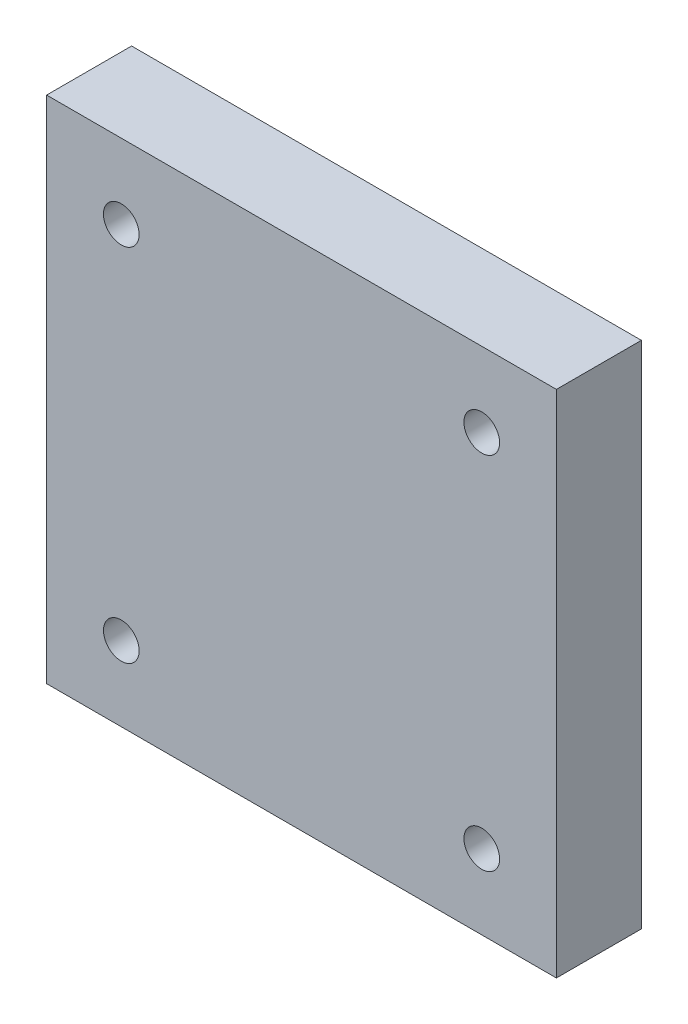
ISO-10303-21;
HEADER;
FILE_DESCRIPTION(('STEP AP214'),'2;1');
FILE_NAME('part.step','',(''),(''),'','','');
FILE_SCHEMA(('AUTOMOTIVE_DESIGN { 1 0 10303 214 1 1 1 1 }'));
ENDSEC;
DATA;
#1=APPLICATION_CONTEXT('core data for automotive mechanical design processes');
#2=APPLICATION_PROTOCOL_DEFINITION('international standard','automotive_design',2000,#1);
#3=PRODUCT_CONTEXT('',#1,'mechanical');
#4=PRODUCT('Part','Part','',(#3));
#5=PRODUCT_RELATED_PRODUCT_CATEGORY('part','',(#4));
#6=PRODUCT_DEFINITION_FORMATION('','',#4);
#7=PRODUCT_DEFINITION_CONTEXT('part definition',#1,'design');
#8=PRODUCT_DEFINITION('design','',#6,#7);
#9=PRODUCT_DEFINITION_SHAPE('','',#8);
#10=(LENGTH_UNIT() NAMED_UNIT(*) SI_UNIT(.MILLI.,.METRE.));
#11=(NAMED_UNIT(*) PLANE_ANGLE_UNIT() SI_UNIT($,.RADIAN.));
#12=(NAMED_UNIT(*) SI_UNIT($,.STERADIAN.) SOLID_ANGLE_UNIT());
#13=UNCERTAINTY_MEASURE_WITH_UNIT(LENGTH_MEASURE(1.E-05),#10,'distance_accuracy_value','');
#14=(GEOMETRIC_REPRESENTATION_CONTEXT(3) GLOBAL_UNCERTAINTY_ASSIGNED_CONTEXT((#13)) GLOBAL_UNIT_ASSIGNED_CONTEXT((#10,
#11,#12)) REPRESENTATION_CONTEXT('',''));
#15=CARTESIAN_POINT('',(0.,0.,0.));
#16=DIRECTION('',(0.,0.,1.));
#17=DIRECTION('',(1.,0.,0.));
#18=AXIS2_PLACEMENT_3D('',#15,#16,#17);
#19=CARTESIAN_POINT('',(0.,30.,5.));
#20=DIRECTION('',(0.,0.,-1.));
#21=DIRECTION('',(-1.,0.,0.));
#22=AXIS2_PLACEMENT_3D('',#19,#20,#21);
#23=PLANE('',#22);
#24=CARTESIAN_POINT('',(4.39339828220179,25.6066017177982,5.));
#25=DIRECTION('',(0.,0.,-1.));
#26=DIRECTION('',(-1.,0.,0.));
#27=AXIS2_PLACEMENT_3D('',#24,#25,#26);
#28=CIRCLE('',#27,1.05);
#29=CARTESIAN_POINT('',(3.34339828220179,25.6066017177982,5.));
#30=VERTEX_POINT('',#29);
#31=EDGE_CURVE('E114',#30,#30,#28,.F.);
#32=ORIENTED_EDGE('',*,*,#31,.F.);
#33=EDGE_LOOP('',(#32));
#34=FACE_BOUND('',#33,.T.);
#35=CARTESIAN_POINT('',(25.6066017177982,25.6066017177982,5.));
#36=DIRECTION('',(0.,0.,-1.));
#37=DIRECTION('',(-1.,0.,0.));
#38=AXIS2_PLACEMENT_3D('',#35,#36,#37);
#39=CIRCLE('',#38,1.05);
#40=CARTESIAN_POINT('',(24.5566017177982,25.6066017177982,5.));
#41=VERTEX_POINT('',#40);
#42=EDGE_CURVE('E102',#41,#41,#39,.F.);
#43=ORIENTED_EDGE('',*,*,#42,.F.);
#44=EDGE_LOOP('',(#43));
#45=FACE_BOUND('',#44,.T.);
#46=DIRECTION('',(0.,-1.,0.));
#47=VECTOR('',#46,1.);
#48=CARTESIAN_POINT('',(0.,0.,5.));
#49=LINE('',#48,#47);
#50=CARTESIAN_POINT('',(0.,30.,5.));
#51=VERTEX_POINT('',#50);
#52=CARTESIAN_POINT('',(0.,0.,5.));
#53=VERTEX_POINT('',#52);
#54=EDGE_CURVE('E86',#51,#53,#49,.T.);
#55=ORIENTED_EDGE('',*,*,#54,.T.);
#56=DIRECTION('',(1.,0.,0.));
#57=VECTOR('',#56,1.);
#58=CARTESIAN_POINT('',(0.,0.,5.));
#59=LINE('',#58,#57);
#60=CARTESIAN_POINT('',(30.,0.,5.));
#61=VERTEX_POINT('',#60);
#62=EDGE_CURVE('E81',#53,#61,#59,.T.);
#63=ORIENTED_EDGE('',*,*,#62,.T.);
#64=DIRECTION('',(0.,1.,0.));
#65=VECTOR('',#64,1.);
#66=CARTESIAN_POINT('',(30.,0.,5.));
#67=LINE('',#66,#65);
#68=CARTESIAN_POINT('',(30.,30.,5.));
#69=VERTEX_POINT('',#68);
#70=EDGE_CURVE('E84',#61,#69,#67,.T.);
#71=ORIENTED_EDGE('',*,*,#70,.T.);
#72=DIRECTION('',(-1.,0.,0.));
#73=VECTOR('',#72,1.);
#74=CARTESIAN_POINT('',(0.,30.,5.));
#75=LINE('',#74,#73);
#76=EDGE_CURVE('E51',#69,#51,#75,.T.);
#77=ORIENTED_EDGE('',*,*,#76,.T.);
#78=EDGE_LOOP('',(#55,#63,#71,#77));
#79=FACE_BOUND('',#78,.T.);
#80=CARTESIAN_POINT('',(25.6066017177982,4.39339828220178,5.));
#81=DIRECTION('',(0.,0.,-1.));
#82=DIRECTION('',(-1.,0.,0.));
#83=AXIS2_PLACEMENT_3D('',#80,#81,#82);
#84=CIRCLE('',#83,1.05);
#85=CARTESIAN_POINT('',(24.5566017177982,4.39339828220178,5.));
#86=VERTEX_POINT('',#85);
#87=EDGE_CURVE('E111',#86,#86,#84,.F.);
#88=ORIENTED_EDGE('',*,*,#87,.F.);
#89=EDGE_LOOP('',(#88));
#90=FACE_BOUND('',#89,.T.);
#91=CARTESIAN_POINT('',(4.39339828220179,4.39339828220179,5.));
#92=DIRECTION('',(0.,0.,-1.));
#93=DIRECTION('',(-1.,0.,0.));
#94=AXIS2_PLACEMENT_3D('',#91,#92,#93);
#95=CIRCLE('',#94,1.05);
#96=CARTESIAN_POINT('',(3.34339828220179,4.39339828220179,5.));
#97=VERTEX_POINT('',#96);
#98=EDGE_CURVE('E117',#97,#97,#95,.F.);
#99=ORIENTED_EDGE('',*,*,#98,.F.);
#100=EDGE_LOOP('',(#99));
#101=FACE_BOUND('',#100,.T.);
#102=ADVANCED_FACE('F32',(#34,#45,#79,#90,#101),#23,.F.);
#103=CARTESIAN_POINT('',(0.,30.,0.));
#104=DIRECTION('',(0.,0.,-1.));
#105=DIRECTION('',(-1.,0.,0.));
#106=AXIS2_PLACEMENT_3D('',#103,#104,#105);
#107=PLANE('',#106);
#108=CARTESIAN_POINT('',(4.39339828220179,25.6066017177982,0.));
#109=DIRECTION('',(0.,0.,-1.));
#110=DIRECTION('',(-1.,0.,0.));
#111=AXIS2_PLACEMENT_3D('',#108,#109,#110);
#112=CIRCLE('',#111,1.05);
#113=CARTESIAN_POINT('',(3.34339828220179,25.6066017177982,0.));
#114=VERTEX_POINT('',#113);
#115=EDGE_CURVE('E115',#114,#114,#112,.F.);
#116=ORIENTED_EDGE('',*,*,#115,.T.);
#117=EDGE_LOOP('',(#116));
#118=FACE_BOUND('',#117,.T.);
#119=CARTESIAN_POINT('',(25.6066017177982,25.6066017177982,0.));
#120=DIRECTION('',(0.,0.,-1.));
#121=DIRECTION('',(-1.,0.,0.));
#122=AXIS2_PLACEMENT_3D('',#119,#120,#121);
#123=CIRCLE('',#122,1.05);
#124=CARTESIAN_POINT('',(24.5566017177982,25.6066017177982,0.));
#125=VERTEX_POINT('',#124);
#126=EDGE_CURVE('E108',#125,#125,#123,.F.);
#127=ORIENTED_EDGE('',*,*,#126,.T.);
#128=EDGE_LOOP('',(#127));
#129=FACE_BOUND('',#128,.T.);
#130=DIRECTION('',(0.,-1.,0.));
#131=VECTOR('',#130,1.);
#132=CARTESIAN_POINT('',(0.,0.,0.));
#133=LINE('',#132,#131);
#134=CARTESIAN_POINT('',(0.,30.,0.));
#135=VERTEX_POINT('',#134);
#136=CARTESIAN_POINT('',(0.,0.,0.));
#137=VERTEX_POINT('',#136);
#138=EDGE_CURVE('E99',#135,#137,#133,.T.);
#139=ORIENTED_EDGE('',*,*,#138,.F.);
#140=DIRECTION('',(-1.,0.,0.));
#141=VECTOR('',#140,1.);
#142=CARTESIAN_POINT('',(0.,30.,0.));
#143=LINE('',#142,#141);
#144=CARTESIAN_POINT('',(30.,30.,0.));
#145=VERTEX_POINT('',#144);
#146=EDGE_CURVE('E74',#145,#135,#143,.T.);
#147=ORIENTED_EDGE('',*,*,#146,.F.);
#148=DIRECTION('',(0.,1.,0.));
#149=VECTOR('',#148,1.);
#150=CARTESIAN_POINT('',(30.,0.,0.));
#151=LINE('',#150,#149);
#152=CARTESIAN_POINT('',(30.,0.,0.));
#153=VERTEX_POINT('',#152);
#154=EDGE_CURVE('E68',#153,#145,#151,.T.);
#155=ORIENTED_EDGE('',*,*,#154,.F.);
#156=DIRECTION('',(1.,0.,0.));
#157=VECTOR('',#156,1.);
#158=CARTESIAN_POINT('',(0.,0.,0.));
#159=LINE('',#158,#157);
#160=EDGE_CURVE('E90',#137,#153,#159,.T.);
#161=ORIENTED_EDGE('',*,*,#160,.F.);
#162=EDGE_LOOP('',(#139,#147,#155,#161));
#163=FACE_BOUND('',#162,.T.);
#164=CARTESIAN_POINT('',(25.6066017177982,4.39339828220178,0.));
#165=DIRECTION('',(0.,0.,-1.));
#166=DIRECTION('',(-1.,0.,0.));
#167=AXIS2_PLACEMENT_3D('',#164,#165,#166);
#168=CIRCLE('',#167,1.05);
#169=CARTESIAN_POINT('',(24.5566017177982,4.39339828220178,0.));
#170=VERTEX_POINT('',#169);
#171=EDGE_CURVE('E112',#170,#170,#168,.F.);
#172=ORIENTED_EDGE('',*,*,#171,.T.);
#173=EDGE_LOOP('',(#172));
#174=FACE_BOUND('',#173,.T.);
#175=CARTESIAN_POINT('',(4.39339828220179,4.39339828220179,0.));
#176=DIRECTION('',(0.,0.,-1.));
#177=DIRECTION('',(-1.,0.,0.));
#178=AXIS2_PLACEMENT_3D('',#175,#176,#177);
#179=CIRCLE('',#178,1.05);
#180=CARTESIAN_POINT('',(3.34339828220179,4.39339828220179,0.));
#181=VERTEX_POINT('',#180);
#182=EDGE_CURVE('E36',#181,#181,#179,.F.);
#183=ORIENTED_EDGE('',*,*,#182,.T.);
#184=EDGE_LOOP('',(#183));
#185=FACE_BOUND('',#184,.T.);
#186=ADVANCED_FACE('F136',(#118,#129,#163,#174,#185),#107,.T.);
#187=CARTESIAN_POINT('',(0.,0.,5.));
#188=DIRECTION('',(1.,0.,0.));
#189=DIRECTION('',(0.,0.,-1.));
#190=AXIS2_PLACEMENT_3D('',#187,#188,#189);
#191=PLANE('',#190);
#192=ORIENTED_EDGE('',*,*,#138,.T.);
#193=DIRECTION('',(0.,0.,-1.));
#194=VECTOR('',#193,1.);
#195=CARTESIAN_POINT('',(0.,0.,5.));
#196=LINE('',#195,#194);
#197=EDGE_CURVE('E11',#53,#137,#196,.T.);
#198=ORIENTED_EDGE('',*,*,#197,.F.);
#199=ORIENTED_EDGE('',*,*,#54,.F.);
#200=DIRECTION('',(0.,0.,-1.));
#201=VECTOR('',#200,1.);
#202=CARTESIAN_POINT('',(0.,30.,5.));
#203=LINE('',#202,#201);
#204=EDGE_CURVE('E95',#51,#135,#203,.T.);
#205=ORIENTED_EDGE('',*,*,#204,.T.);
#206=EDGE_LOOP('',(#192,#198,#199,#205));
#207=FACE_BOUND('',#206,.T.);
#208=ADVANCED_FACE('F34',(#207),#191,.F.);
#209=CARTESIAN_POINT('',(0.,0.,5.));
#210=DIRECTION('',(0.,1.,0.));
#211=DIRECTION('',(0.,0.,1.));
#212=AXIS2_PLACEMENT_3D('',#209,#210,#211);
#213=PLANE('',#212);
#214=ORIENTED_EDGE('',*,*,#160,.T.);
#215=DIRECTION('',(0.,0.,-1.));
#216=VECTOR('',#215,1.);
#217=CARTESIAN_POINT('',(30.,0.,5.));
#218=LINE('',#217,#216);
#219=EDGE_CURVE('E42',#61,#153,#218,.T.);
#220=ORIENTED_EDGE('',*,*,#219,.F.);
#221=ORIENTED_EDGE('',*,*,#62,.F.);
#222=ORIENTED_EDGE('',*,*,#197,.T.);
#223=EDGE_LOOP('',(#214,#220,#221,#222));
#224=FACE_BOUND('',#223,.T.);
#225=ADVANCED_FACE('F89',(#224),#213,.F.);
#226=CARTESIAN_POINT('',(30.,0.,5.));
#227=DIRECTION('',(-1.,0.,0.));
#228=DIRECTION('',(0.,0.,1.));
#229=AXIS2_PLACEMENT_3D('',#226,#227,#228);
#230=PLANE('',#229);
#231=ORIENTED_EDGE('',*,*,#154,.T.);
#232=DIRECTION('',(0.,0.,-1.));
#233=VECTOR('',#232,1.);
#234=CARTESIAN_POINT('',(30.,30.,5.));
#235=LINE('',#234,#233);
#236=EDGE_CURVE('E91',#69,#145,#235,.T.);
#237=ORIENTED_EDGE('',*,*,#236,.F.);
#238=ORIENTED_EDGE('',*,*,#70,.F.);
#239=ORIENTED_EDGE('',*,*,#219,.T.);
#240=EDGE_LOOP('',(#231,#237,#238,#239));
#241=FACE_BOUND('',#240,.T.);
#242=ADVANCED_FACE('F93',(#241),#230,.F.);
#243=CARTESIAN_POINT('',(0.,30.,5.));
#244=DIRECTION('',(0.,-1.,0.));
#245=DIRECTION('',(0.,0.,-1.));
#246=AXIS2_PLACEMENT_3D('',#243,#244,#245);
#247=PLANE('',#246);
#248=ORIENTED_EDGE('',*,*,#146,.T.);
#249=ORIENTED_EDGE('',*,*,#204,.F.);
#250=ORIENTED_EDGE('',*,*,#76,.F.);
#251=ORIENTED_EDGE('',*,*,#236,.T.);
#252=EDGE_LOOP('',(#248,#249,#250,#251));
#253=FACE_BOUND('',#252,.T.);
#254=ADVANCED_FACE('F147',(#253),#247,.F.);
#255=CARTESIAN_POINT('',(25.6066017177982,25.6066017177982,15.4));
#256=DIRECTION('',(0.,0.,-1.));
#257=DIRECTION('',(-1.,0.,0.));
#258=AXIS2_PLACEMENT_3D('',#255,#256,#257);
#259=CYLINDRICAL_SURFACE('',#258,1.05);
#260=ORIENTED_EDGE('',*,*,#126,.F.);
#261=EDGE_LOOP('',(#260));
#262=FACE_BOUND('',#261,.T.);
#263=ORIENTED_EDGE('',*,*,#42,.T.);
#264=EDGE_LOOP('',(#263));
#265=FACE_BOUND('',#264,.T.);
#266=ADVANCED_FACE('F133',(#262,#265),#259,.F.);
#267=CARTESIAN_POINT('',(25.6066017177982,4.39339828220178,15.4));
#268=DIRECTION('',(0.,0.,-1.));
#269=DIRECTION('',(-0.989337190979772,0.145643134215977,0.));
#270=AXIS2_PLACEMENT_3D('',#267,#268,#269);
#271=CYLINDRICAL_SURFACE('',#270,1.05);
#272=ORIENTED_EDGE('',*,*,#171,.F.);
#273=EDGE_LOOP('',(#272));
#274=FACE_BOUND('',#273,.T.);
#275=ORIENTED_EDGE('',*,*,#87,.T.);
#276=EDGE_LOOP('',(#275));
#277=FACE_BOUND('',#276,.T.);
#278=ADVANCED_FACE('F172',(#274,#277),#271,.F.);
#279=CARTESIAN_POINT('',(4.39339828220179,25.6066017177982,15.4));
#280=DIRECTION('',(0.,0.,-1.));
#281=DIRECTION('',(-1.,0.,0.));
#282=AXIS2_PLACEMENT_3D('',#279,#280,#281);
#283=CYLINDRICAL_SURFACE('',#282,1.05);
#284=ORIENTED_EDGE('',*,*,#115,.F.);
#285=EDGE_LOOP('',(#284));
#286=FACE_BOUND('',#285,.T.);
#287=ORIENTED_EDGE('',*,*,#31,.T.);
#288=EDGE_LOOP('',(#287));
#289=FACE_BOUND('',#288,.T.);
#290=ADVANCED_FACE('F167',(#286,#289),#283,.F.);
#291=CARTESIAN_POINT('',(4.39339828220179,4.39339828220179,15.4));
#292=DIRECTION('',(0.,0.,-1.));
#293=DIRECTION('',(-1.,0.,0.));
#294=AXIS2_PLACEMENT_3D('',#291,#292,#293);
#295=CYLINDRICAL_SURFACE('',#294,1.05);
#296=ORIENTED_EDGE('',*,*,#182,.F.);
#297=EDGE_LOOP('',(#296));
#298=FACE_BOUND('',#297,.T.);
#299=ORIENTED_EDGE('',*,*,#98,.T.);
#300=EDGE_LOOP('',(#299));
#301=FACE_BOUND('',#300,.T.);
#302=ADVANCED_FACE('F165',(#298,#301),#295,.F.);
#303=CLOSED_SHELL('',(#102,#186,#208,#225,#242,#254,#266,#278,#290,#302));
#304=MANIFOLD_SOLID_BREP('B2',#303);
#305=ADVANCED_BREP_SHAPE_REPRESENTATION('',(#18,#304),#14);
#306=SHAPE_DEFINITION_REPRESENTATION(#9,#305);
ENDSEC;
END-ISO-10303-21;
